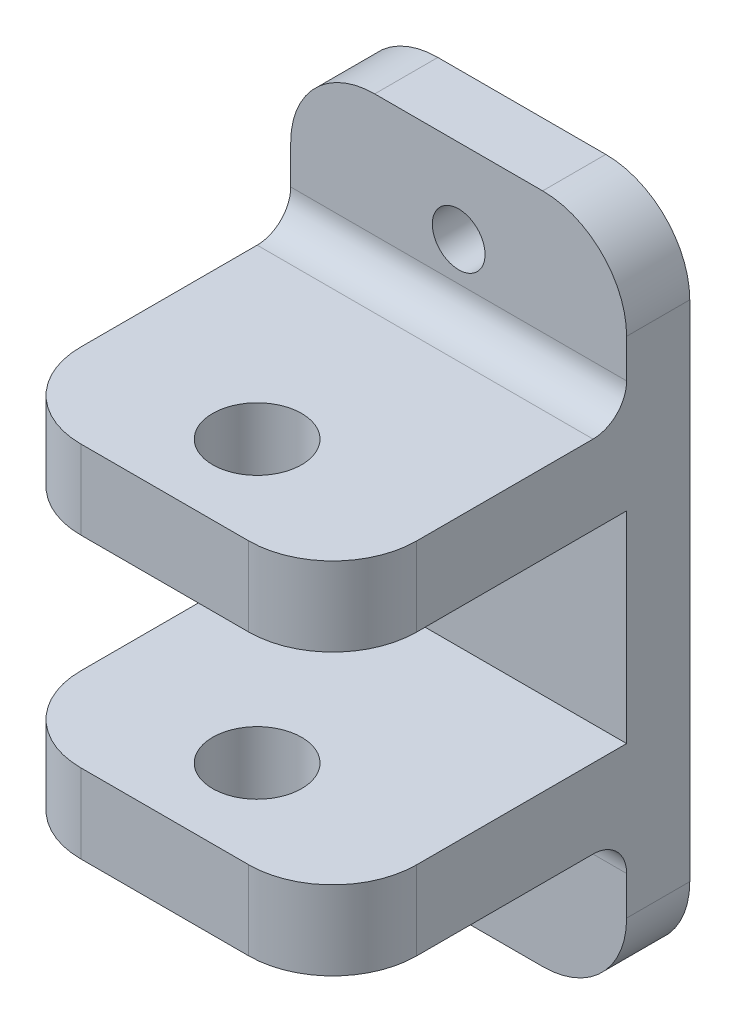
ISO-10303-21;
HEADER;
FILE_DESCRIPTION(('STEP AP214'),'2;1');
FILE_NAME('part.step','',(''),(''),'','','');
FILE_SCHEMA(('AUTOMOTIVE_DESIGN { 1 0 10303 214 1 1 1 1 }'));
ENDSEC;
DATA;
#1=APPLICATION_CONTEXT('core data for automotive mechanical design processes');
#2=APPLICATION_PROTOCOL_DEFINITION('international standard','automotive_design',2000,#1);
#3=PRODUCT_CONTEXT('',#1,'mechanical');
#4=PRODUCT('Part','Part','',(#3));
#5=PRODUCT_RELATED_PRODUCT_CATEGORY('part','',(#4));
#6=PRODUCT_DEFINITION_FORMATION('','',#4);
#7=PRODUCT_DEFINITION_CONTEXT('part definition',#1,'design');
#8=PRODUCT_DEFINITION('design','',#6,#7);
#9=PRODUCT_DEFINITION_SHAPE('','',#8);
#10=(LENGTH_UNIT() NAMED_UNIT(*) SI_UNIT(.MILLI.,.METRE.));
#11=(NAMED_UNIT(*) PLANE_ANGLE_UNIT() SI_UNIT($,.RADIAN.));
#12=(NAMED_UNIT(*) SI_UNIT($,.STERADIAN.) SOLID_ANGLE_UNIT());
#13=UNCERTAINTY_MEASURE_WITH_UNIT(LENGTH_MEASURE(1.E-05),#10,'distance_accuracy_value','');
#14=(GEOMETRIC_REPRESENTATION_CONTEXT(3) GLOBAL_UNCERTAINTY_ASSIGNED_CONTEXT((#13)) GLOBAL_UNIT_ASSIGNED_CONTEXT((#10,
#11,#12)) REPRESENTATION_CONTEXT('',''));
#15=CARTESIAN_POINT('',(0.,0.,0.));
#16=DIRECTION('',(0.,0.,1.));
#17=DIRECTION('',(1.,0.,0.));
#18=AXIS2_PLACEMENT_3D('',#15,#16,#17);
#19=CARTESIAN_POINT('',(0.,0.,4.7752));
#20=DIRECTION('',(0.,0.,1.));
#21=DIRECTION('',(0.,-1.,0.));
#22=AXIS2_PLACEMENT_3D('',#19,#20,#21);
#23=PLANE('',#22);
#24=DIRECTION('',(1.,0.,0.));
#25=VECTOR('',#24,1.);
#26=CARTESIAN_POINT('',(0.,24.13,4.7752));
#27=LINE('',#26,#25);
#28=CARTESIAN_POINT('',(-25.4,24.13,4.7752));
#29=VERTEX_POINT('',#28);
#30=CARTESIAN_POINT('',(0.,24.13,4.7752));
#31=VERTEX_POINT('',#30);
#32=EDGE_CURVE('E298',#29,#31,#27,.T.);
#33=ORIENTED_EDGE('',*,*,#32,.T.);
#34=DIRECTION('',(0.,-1.,0.));
#35=VECTOR('',#34,1.);
#36=CARTESIAN_POINT('',(0.,63.5,4.7752));
#37=LINE('',#36,#35);
#38=CARTESIAN_POINT('',(0.,39.37,4.7752));
#39=VERTEX_POINT('',#38);
#40=EDGE_CURVE('E445',#39,#31,#37,.T.);
#41=ORIENTED_EDGE('',*,*,#40,.F.);
#42=DIRECTION('',(-1.,0.,0.));
#43=VECTOR('',#42,1.);
#44=CARTESIAN_POINT('',(-12.7,39.37,4.7752));
#45=LINE('',#44,#43);
#46=CARTESIAN_POINT('',(-25.4,39.37,4.7752));
#47=VERTEX_POINT('',#46);
#48=EDGE_CURVE('E26',#39,#47,#45,.T.);
#49=ORIENTED_EDGE('',*,*,#48,.T.);
#50=DIRECTION('',(0.,1.,0.));
#51=VECTOR('',#50,1.);
#52=CARTESIAN_POINT('',(-25.4,63.5,4.7752));
#53=LINE('',#52,#51);
#54=EDGE_CURVE('E419',#29,#47,#53,.T.);
#55=ORIENTED_EDGE('',*,*,#54,.F.);
#56=EDGE_LOOP('',(#33,#41,#49,#55));
#57=FACE_BOUND('',#56,.T.);
#58=ADVANCED_FACE('F17',(#57),#23,.T.);
#59=CARTESIAN_POINT('',(-12.7,42.3545,27.0002));
#60=DIRECTION('',(0.,0.,1.));
#61=DIRECTION('',(1.,0.,0.));
#62=AXIS2_PLACEMENT_3D('',#59,#60,#61);
#63=PLANE('',#62);
#64=DIRECTION('',(0.,1.,0.));
#65=VECTOR('',#64,1.);
#66=CARTESIAN_POINT('',(-19.05,37.05225,27.0002));
#67=LINE('',#66,#65);
#68=CARTESIAN_POINT('',(-19.05,39.37,27.0002));
#69=VERTEX_POINT('',#68);
#70=CARTESIAN_POINT('',(-19.05,45.339,27.0002));
#71=VERTEX_POINT('',#70);
#72=EDGE_CURVE('E393',#69,#71,#67,.T.);
#73=ORIENTED_EDGE('',*,*,#72,.F.);
#74=DIRECTION('',(1.,0.,0.));
#75=VECTOR('',#74,1.);
#76=CARTESIAN_POINT('',(-25.4,39.37,27.0002));
#77=LINE('',#76,#75);
#78=CARTESIAN_POINT('',(-6.35,39.37,27.0002));
#79=VERTEX_POINT('',#78);
#80=EDGE_CURVE('E11',#69,#79,#77,.T.);
#81=ORIENTED_EDGE('',*,*,#80,.T.);
#82=DIRECTION('',(0.,-1.,0.));
#83=VECTOR('',#82,1.);
#84=CARTESIAN_POINT('',(-6.35,37.05225,27.0002));
#85=LINE('',#84,#83);
#86=CARTESIAN_POINT('',(-6.35,45.339,27.0002));
#87=VERTEX_POINT('',#86);
#88=EDGE_CURVE('E428',#87,#79,#85,.T.);
#89=ORIENTED_EDGE('',*,*,#88,.F.);
#90=DIRECTION('',(-1.,0.,0.));
#91=VECTOR('',#90,1.);
#92=CARTESIAN_POINT('',(0.,45.339,27.0002));
#93=LINE('',#92,#91);
#94=EDGE_CURVE('E518',#87,#71,#93,.T.);
#95=ORIENTED_EDGE('',*,*,#94,.T.);
#96=EDGE_LOOP('',(#73,#81,#89,#95));
#97=FACE_BOUND('',#96,.T.);
#98=ADVANCED_FACE('F556',(#97),#63,.T.);
#99=CARTESIAN_POINT('',(-25.4,39.37,4.7752));
#100=DIRECTION('',(0.,-1.,0.));
#101=DIRECTION('',(0.,0.,-1.));
#102=AXIS2_PLACEMENT_3D('',#99,#100,#101);
#103=PLANE('',#102);
#104=CARTESIAN_POINT('',(-12.7,39.37,20.0152));
#105=DIRECTION('',(0.,1.,0.));
#106=DIRECTION('',(1.,0.,0.));
#107=AXIS2_PLACEMENT_3D('',#104,#105,#106);
#108=CIRCLE('',#107,3.3655);
#109=CARTESIAN_POINT('',(-16.0655,39.37,20.0152));
#110=VERTEX_POINT('',#109);
#111=EDGE_CURVE('E50',#110,#110,#108,.T.);
#112=ORIENTED_EDGE('',*,*,#111,.T.);
#113=EDGE_LOOP('',(#112));
#114=FACE_BOUND('',#113,.T.);
#115=CARTESIAN_POINT('',(-19.05,39.37,20.6502));
#116=DIRECTION('',(0.,1.,0.));
#117=DIRECTION('',(-0.707106781186548,0.,0.707106781186547));
#118=AXIS2_PLACEMENT_3D('',#115,#116,#117);
#119=CIRCLE('',#118,6.35);
#120=CARTESIAN_POINT('',(-25.4,39.37,20.6502));
#121=VERTEX_POINT('',#120);
#122=EDGE_CURVE('E513',#121,#69,#119,.T.);
#123=ORIENTED_EDGE('',*,*,#122,.F.);
#124=DIRECTION('',(0.,0.,1.));
#125=VECTOR('',#124,1.);
#126=CARTESIAN_POINT('',(-25.4,39.37,4.7752));
#127=LINE('',#126,#125);
#128=EDGE_CURVE('E425',#47,#121,#127,.T.);
#129=ORIENTED_EDGE('',*,*,#128,.F.);
#130=ORIENTED_EDGE('',*,*,#48,.F.);
#131=DIRECTION('',(0.,0.,1.));
#132=VECTOR('',#131,1.);
#133=CARTESIAN_POINT('',(0.,39.37,4.7752));
#134=LINE('',#133,#132);
#135=CARTESIAN_POINT('',(0.,39.37,20.6502));
#136=VERTEX_POINT('',#135);
#137=EDGE_CURVE('E439',#39,#136,#134,.T.);
#138=ORIENTED_EDGE('',*,*,#137,.T.);
#139=CARTESIAN_POINT('',(-6.35,39.37,20.6502));
#140=DIRECTION('',(0.,1.,0.));
#141=DIRECTION('',(0.707106781186548,0.,0.707106781186547));
#142=AXIS2_PLACEMENT_3D('',#139,#140,#141);
#143=CIRCLE('',#142,6.35);
#144=EDGE_CURVE('E432',#79,#136,#143,.T.);
#145=ORIENTED_EDGE('',*,*,#144,.F.);
#146=ORIENTED_EDGE('',*,*,#80,.F.);
#147=EDGE_LOOP('',(#123,#129,#130,#138,#145,#146));
#148=FACE_BOUND('',#147,.T.);
#149=ADVANCED_FACE('F550',(#114,#148),#103,.T.);
#150=CARTESIAN_POINT('',(-12.7,21.1455,27.0002));
#151=DIRECTION('',(0.,0.,1.));
#152=DIRECTION('',(0.,-1.,0.));
#153=AXIS2_PLACEMENT_3D('',#150,#151,#152);
#154=PLANE('',#153);
#155=DIRECTION('',(0.,-1.,0.));
#156=VECTOR('',#155,1.);
#157=CARTESIAN_POINT('',(-6.35,26.44775,27.0002));
#158=LINE('',#157,#156);
#159=CARTESIAN_POINT('',(-6.35,24.13,27.0002));
#160=VERTEX_POINT('',#159);
#161=CARTESIAN_POINT('',(-6.35,18.161,27.0002));
#162=VERTEX_POINT('',#161);
#163=EDGE_CURVE('E319',#160,#162,#158,.T.);
#164=ORIENTED_EDGE('',*,*,#163,.F.);
#165=DIRECTION('',(-1.,0.,0.));
#166=VECTOR('',#165,1.);
#167=CARTESIAN_POINT('',(0.,24.13,27.0002));
#168=LINE('',#167,#166);
#169=CARTESIAN_POINT('',(-19.05,24.13,27.0002));
#170=VERTEX_POINT('',#169);
#171=EDGE_CURVE('E20',#160,#170,#168,.T.);
#172=ORIENTED_EDGE('',*,*,#171,.T.);
#173=DIRECTION('',(0.,1.,0.));
#174=VECTOR('',#173,1.);
#175=CARTESIAN_POINT('',(-19.05,26.44775,27.0002));
#176=LINE('',#175,#174);
#177=CARTESIAN_POINT('',(-19.05,18.161,27.0002));
#178=VERTEX_POINT('',#177);
#179=EDGE_CURVE('E316',#178,#170,#176,.T.);
#180=ORIENTED_EDGE('',*,*,#179,.F.);
#181=DIRECTION('',(1.,0.,0.));
#182=VECTOR('',#181,1.);
#183=CARTESIAN_POINT('',(-25.4,18.161,27.0002));
#184=LINE('',#183,#182);
#185=EDGE_CURVE('E505',#178,#162,#184,.T.);
#186=ORIENTED_EDGE('',*,*,#185,.T.);
#187=EDGE_LOOP('',(#164,#172,#180,#186));
#188=FACE_BOUND('',#187,.T.);
#189=ADVANCED_FACE('F313',(#188),#154,.T.);
#190=CARTESIAN_POINT('',(0.,24.13,4.7752));
#191=DIRECTION('',(0.,1.,0.));
#192=DIRECTION('',(0.,0.,-1.));
#193=AXIS2_PLACEMENT_3D('',#190,#191,#192);
#194=PLANE('',#193);
#195=CARTESIAN_POINT('',(-12.7,24.13,20.0152));
#196=DIRECTION('',(0.,-1.,0.));
#197=DIRECTION('',(1.,0.,0.));
#198=AXIS2_PLACEMENT_3D('',#195,#196,#197);
#199=CIRCLE('',#198,3.3655);
#200=CARTESIAN_POINT('',(-16.0655,24.13,20.0152));
#201=VERTEX_POINT('',#200);
#202=EDGE_CURVE('E290',#201,#201,#199,.T.);
#203=ORIENTED_EDGE('',*,*,#202,.T.);
#204=EDGE_LOOP('',(#203));
#205=FACE_BOUND('',#204,.T.);
#206=CARTESIAN_POINT('',(-6.35,24.13,20.6502));
#207=DIRECTION('',(0.,-1.,0.));
#208=DIRECTION('',(0.707106781186548,0.,0.707106781186547));
#209=AXIS2_PLACEMENT_3D('',#206,#207,#208);
#210=CIRCLE('',#209,6.35);
#211=CARTESIAN_POINT('',(0.,24.13,20.6502));
#212=VERTEX_POINT('',#211);
#213=EDGE_CURVE('E341',#212,#160,#210,.T.);
#214=ORIENTED_EDGE('',*,*,#213,.F.);
#215=DIRECTION('',(0.,0.,1.));
#216=VECTOR('',#215,1.);
#217=CARTESIAN_POINT('',(0.,24.13,4.7752));
#218=LINE('',#217,#216);
#219=EDGE_CURVE('E440',#31,#212,#218,.T.);
#220=ORIENTED_EDGE('',*,*,#219,.F.);
#221=ORIENTED_EDGE('',*,*,#32,.F.);
#222=DIRECTION('',(0.,0.,1.));
#223=VECTOR('',#222,1.);
#224=CARTESIAN_POINT('',(-25.4,24.13,4.7752));
#225=LINE('',#224,#223);
#226=CARTESIAN_POINT('',(-25.4,24.13,20.6502));
#227=VERTEX_POINT('',#226);
#228=EDGE_CURVE('E326',#29,#227,#225,.T.);
#229=ORIENTED_EDGE('',*,*,#228,.T.);
#230=CARTESIAN_POINT('',(-19.05,24.13,20.6502));
#231=DIRECTION('',(0.,-1.,0.));
#232=DIRECTION('',(-0.707106781186548,0.,0.707106781186547));
#233=AXIS2_PLACEMENT_3D('',#230,#231,#232);
#234=CIRCLE('',#233,6.35);
#235=EDGE_CURVE('E323',#170,#227,#234,.T.);
#236=ORIENTED_EDGE('',*,*,#235,.F.);
#237=ORIENTED_EDGE('',*,*,#171,.F.);
#238=EDGE_LOOP('',(#214,#220,#221,#229,#236,#237));
#239=FACE_BOUND('',#238,.T.);
#240=ADVANCED_FACE('F324',(#205,#239),#194,.T.);
#241=CARTESIAN_POINT('',(-12.7,50.8,4.7752));
#242=DIRECTION('',(0.,0.,-1.));
#243=DIRECTION('',(1.,0.,0.));
#244=AXIS2_PLACEMENT_3D('',#241,#242,#243);
#245=CYLINDRICAL_SURFACE('',#244,1.9939);
#246=CARTESIAN_POINT('',(-12.7,50.8,4.7752));
#247=DIRECTION('',(0.,0.,-1.));
#248=DIRECTION('',(1.,0.,0.));
#249=AXIS2_PLACEMENT_3D('',#246,#247,#248);
#250=CIRCLE('',#249,1.9939);
#251=CARTESIAN_POINT('',(-14.6939,50.8,4.7752));
#252=VERTEX_POINT('',#251);
#253=EDGE_CURVE('E276',#252,#252,#250,.T.);
#254=ORIENTED_EDGE('',*,*,#253,.F.);
#255=DIRECTION('',(0.,0.,-1.));
#256=VECTOR('',#255,1.);
#257=CARTESIAN_POINT('',(-14.6939,50.8,4.7752));
#258=LINE('',#257,#256);
#259=CARTESIAN_POINT('',(-14.6939,50.8,0.));
#260=VERTEX_POINT('',#259);
#261=EDGE_CURVE('E295',#252,#260,#258,.T.);
#262=ORIENTED_EDGE('',*,*,#261,.T.);
#263=CARTESIAN_POINT('',(-12.7,50.8,0.));
#264=DIRECTION('',(0.,0.,1.));
#265=DIRECTION('',(1.,0.,0.));
#266=AXIS2_PLACEMENT_3D('',#263,#264,#265);
#267=CIRCLE('',#266,1.9939);
#268=EDGE_CURVE('E264',#260,#260,#267,.T.);
#269=ORIENTED_EDGE('',*,*,#268,.F.);
#270=ORIENTED_EDGE('',*,*,#261,.F.);
#271=EDGE_LOOP('',(#254,#262,#269,#270));
#272=FACE_BOUND('',#271,.T.);
#273=ADVANCED_FACE('F676',(#272),#245,.F.);
#274=CARTESIAN_POINT('',(-12.7,12.7,4.7752));
#275=DIRECTION('',(0.,0.,-1.));
#276=DIRECTION('',(1.,0.,0.));
#277=AXIS2_PLACEMENT_3D('',#274,#275,#276);
#278=CYLINDRICAL_SURFACE('',#277,1.9939);
#279=CARTESIAN_POINT('',(-12.7,12.7,4.7752));
#280=DIRECTION('',(0.,0.,-1.));
#281=DIRECTION('',(1.,0.,0.));
#282=AXIS2_PLACEMENT_3D('',#279,#280,#281);
#283=CIRCLE('',#282,1.9939);
#284=CARTESIAN_POINT('',(-14.6939,12.7,4.7752));
#285=VERTEX_POINT('',#284);
#286=EDGE_CURVE('E281',#285,#285,#283,.T.);
#287=ORIENTED_EDGE('',*,*,#286,.F.);
#288=DIRECTION('',(0.,0.,-1.));
#289=VECTOR('',#288,1.);
#290=CARTESIAN_POINT('',(-14.6939,12.7,4.7752));
#291=LINE('',#290,#289);
#292=CARTESIAN_POINT('',(-14.6939,12.7,0.));
#293=VERTEX_POINT('',#292);
#294=EDGE_CURVE('E79',#285,#293,#291,.T.);
#295=ORIENTED_EDGE('',*,*,#294,.T.);
#296=CARTESIAN_POINT('',(-12.7,12.7,0.));
#297=DIRECTION('',(0.,0.,1.));
#298=DIRECTION('',(1.,0.,0.));
#299=AXIS2_PLACEMENT_3D('',#296,#297,#298);
#300=CIRCLE('',#299,1.9939);
#301=EDGE_CURVE('E247',#293,#293,#300,.T.);
#302=ORIENTED_EDGE('',*,*,#301,.F.);
#303=ORIENTED_EDGE('',*,*,#294,.F.);
#304=EDGE_LOOP('',(#287,#295,#302,#303));
#305=FACE_BOUND('',#304,.T.);
#306=ADVANCED_FACE('F665',(#305),#278,.F.);
#307=CARTESIAN_POINT('',(-12.7,45.339,20.0152));
#308=DIRECTION('',(0.,-1.,0.));
#309=DIRECTION('',(1.,0.,0.));
#310=AXIS2_PLACEMENT_3D('',#307,#308,#309);
#311=CYLINDRICAL_SURFACE('',#310,3.3655);
#312=ORIENTED_EDGE('',*,*,#202,.F.);
#313=DIRECTION('',(0.,-1.,0.));
#314=VECTOR('',#313,1.);
#315=CARTESIAN_POINT('',(-16.0655,45.339,20.0152));
#316=LINE('',#315,#314);
#317=CARTESIAN_POINT('',(-16.0655,18.161,20.0152));
#318=VERTEX_POINT('',#317);
#319=EDGE_CURVE('E39',#201,#318,#316,.T.);
#320=ORIENTED_EDGE('',*,*,#319,.T.);
#321=CARTESIAN_POINT('',(-12.7,18.161,20.0152));
#322=DIRECTION('',(0.,1.,0.));
#323=DIRECTION('',(1.,0.,0.));
#324=AXIS2_PLACEMENT_3D('',#321,#322,#323);
#325=CIRCLE('',#324,3.3655);
#326=EDGE_CURVE('E506',#318,#318,#325,.T.);
#327=ORIENTED_EDGE('',*,*,#326,.F.);
#328=ORIENTED_EDGE('',*,*,#319,.F.);
#329=EDGE_LOOP('',(#312,#320,#327,#328));
#330=FACE_BOUND('',#329,.T.);
#331=ADVANCED_FACE('F661',(#330),#311,.F.);
#332=CARTESIAN_POINT('',(-12.7,45.339,20.0152));
#333=DIRECTION('',(0.,-1.,0.));
#334=DIRECTION('',(1.,0.,0.));
#335=AXIS2_PLACEMENT_3D('',#332,#333,#334);
#336=CYLINDRICAL_SURFACE('',#335,3.3655);
#337=CARTESIAN_POINT('',(-12.7,45.339,20.0152));
#338=DIRECTION('',(0.,-1.,0.));
#339=DIRECTION('',(1.,0.,0.));
#340=AXIS2_PLACEMENT_3D('',#337,#338,#339);
#341=CIRCLE('',#340,3.3655);
#342=CARTESIAN_POINT('',(-16.0655,45.339,20.0152));
#343=VERTEX_POINT('',#342);
#344=EDGE_CURVE('E530',#343,#343,#341,.T.);
#345=ORIENTED_EDGE('',*,*,#344,.F.);
#346=DIRECTION('',(0.,-1.,0.));
#347=VECTOR('',#346,1.);
#348=CARTESIAN_POINT('',(-16.0655,45.339,20.0152));
#349=LINE('',#348,#347);
#350=EDGE_CURVE('E280',#343,#110,#349,.T.);
#351=ORIENTED_EDGE('',*,*,#350,.T.);
#352=ORIENTED_EDGE('',*,*,#111,.F.);
#353=ORIENTED_EDGE('',*,*,#350,.F.);
#354=EDGE_LOOP('',(#345,#351,#352,#353));
#355=FACE_BOUND('',#354,.T.);
#356=ADVANCED_FACE('F664',(#355),#336,.F.);
#357=CARTESIAN_POINT('',(0.,0.,4.7752));
#358=DIRECTION('',(0.,0.,1.));
#359=DIRECTION('',(0.,-1.,0.));
#360=AXIS2_PLACEMENT_3D('',#357,#358,#359);
#361=PLANE('',#360);
#362=ORIENTED_EDGE('',*,*,#253,.T.);
#363=EDGE_LOOP('',(#362));
#364=FACE_BOUND('',#363,.T.);
#365=DIRECTION('',(-1.,0.,0.));
#366=VECTOR('',#365,1.);
#367=CARTESIAN_POINT('',(0.,47.879,4.7752));
#368=LINE('',#367,#366);
#369=CARTESIAN_POINT('',(0.,47.879,4.7752));
#370=VERTEX_POINT('',#369);
#371=CARTESIAN_POINT('',(-25.4,47.879,4.7752));
#372=VERTEX_POINT('',#371);
#373=EDGE_CURVE('E477',#370,#372,#368,.T.);
#374=ORIENTED_EDGE('',*,*,#373,.F.);
#375=DIRECTION('',(0.,-1.,0.));
#376=VECTOR('',#375,1.);
#377=CARTESIAN_POINT('',(0.,63.5,4.7752));
#378=LINE('',#377,#376);
#379=CARTESIAN_POINT('',(0.,50.8,4.7752));
#380=VERTEX_POINT('',#379);
#381=EDGE_CURVE('E410',#380,#370,#378,.T.);
#382=ORIENTED_EDGE('',*,*,#381,.F.);
#383=CARTESIAN_POINT('',(-6.35,50.8,4.7752));
#384=DIRECTION('',(0.,0.,-1.));
#385=DIRECTION('',(0.707106781186548,0.707106781186547,0.));
#386=AXIS2_PLACEMENT_3D('',#383,#384,#385);
#387=CIRCLE('',#386,6.35);
#388=CARTESIAN_POINT('',(-6.35,57.15,4.7752));
#389=VERTEX_POINT('',#388);
#390=EDGE_CURVE('E236',#389,#380,#387,.T.);
#391=ORIENTED_EDGE('',*,*,#390,.F.);
#392=DIRECTION('',(-1.,0.,0.));
#393=VECTOR('',#392,1.);
#394=CARTESIAN_POINT('',(0.,57.15,4.7752));
#395=LINE('',#394,#393);
#396=CARTESIAN_POINT('',(-19.05,57.15,4.7752));
#397=VERTEX_POINT('',#396);
#398=EDGE_CURVE('E90',#389,#397,#395,.T.);
#399=ORIENTED_EDGE('',*,*,#398,.T.);
#400=CARTESIAN_POINT('',(-19.05,50.8,4.7752));
#401=DIRECTION('',(0.,0.,-1.));
#402=DIRECTION('',(-0.707106781186548,0.707106781186547,0.));
#403=AXIS2_PLACEMENT_3D('',#400,#401,#402);
#404=CIRCLE('',#403,6.35);
#405=CARTESIAN_POINT('',(-25.4,50.8,4.7752));
#406=VERTEX_POINT('',#405);
#407=EDGE_CURVE('E273',#406,#397,#404,.T.);
#408=ORIENTED_EDGE('',*,*,#407,.F.);
#409=DIRECTION('',(0.,1.,0.));
#410=VECTOR('',#409,1.);
#411=CARTESIAN_POINT('',(-25.4,63.5,4.7752));
#412=LINE('',#411,#410);
#413=EDGE_CURVE('E398',#372,#406,#412,.T.);
#414=ORIENTED_EDGE('',*,*,#413,.F.);
#415=EDGE_LOOP('',(#374,#382,#391,#399,#408,#414));
#416=FACE_BOUND('',#415,.T.);
#417=ADVANCED_FACE('F478',(#364,#416),#361,.T.);
#418=CARTESIAN_POINT('',(0.,0.,4.7752));
#419=DIRECTION('',(0.,0.,1.));
#420=DIRECTION('',(0.,-1.,0.));
#421=AXIS2_PLACEMENT_3D('',#418,#419,#420);
#422=PLANE('',#421);
#423=ORIENTED_EDGE('',*,*,#286,.T.);
#424=EDGE_LOOP('',(#423));
#425=FACE_BOUND('',#424,.T.);
#426=DIRECTION('',(1.,0.,0.));
#427=VECTOR('',#426,1.);
#428=CARTESIAN_POINT('',(-12.7,15.621,4.7752));
#429=LINE('',#428,#427);
#430=CARTESIAN_POINT('',(-25.4,15.621,4.7752));
#431=VERTEX_POINT('',#430);
#432=CARTESIAN_POINT('',(0.,15.621,4.7752));
#433=VERTEX_POINT('',#432);
#434=EDGE_CURVE('E585',#431,#433,#429,.T.);
#435=ORIENTED_EDGE('',*,*,#434,.F.);
#436=DIRECTION('',(0.,1.,0.));
#437=VECTOR('',#436,1.);
#438=CARTESIAN_POINT('',(-25.4,63.5,4.7752));
#439=LINE('',#438,#437);
#440=CARTESIAN_POINT('',(-25.4,12.7,4.7752));
#441=VERTEX_POINT('',#440);
#442=EDGE_CURVE('E407',#441,#431,#439,.T.);
#443=ORIENTED_EDGE('',*,*,#442,.F.);
#444=CARTESIAN_POINT('',(-19.05,12.7,4.7752));
#445=DIRECTION('',(0.,0.,-1.));
#446=DIRECTION('',(-0.707106781186547,-0.707106781186548,0.));
#447=AXIS2_PLACEMENT_3D('',#444,#445,#446);
#448=CIRCLE('',#447,6.35);
#449=CARTESIAN_POINT('',(-19.05,6.35,4.7752));
#450=VERTEX_POINT('',#449);
#451=EDGE_CURVE('E268',#450,#441,#448,.T.);
#452=ORIENTED_EDGE('',*,*,#451,.F.);
#453=DIRECTION('',(1.,0.,0.));
#454=VECTOR('',#453,1.);
#455=CARTESIAN_POINT('',(-12.7,6.35,4.7752));
#456=LINE('',#455,#454);
#457=CARTESIAN_POINT('',(-6.35,6.35,4.7752));
#458=VERTEX_POINT('',#457);
#459=EDGE_CURVE('E235',#450,#458,#456,.T.);
#460=ORIENTED_EDGE('',*,*,#459,.T.);
#461=CARTESIAN_POINT('',(-6.35,12.7,4.7752));
#462=DIRECTION('',(0.,0.,-1.));
#463=DIRECTION('',(0.707106781186547,-0.707106781186548,0.));
#464=AXIS2_PLACEMENT_3D('',#461,#462,#463);
#465=CIRCLE('',#464,6.35);
#466=CARTESIAN_POINT('',(0.,12.7,4.7752));
#467=VERTEX_POINT('',#466);
#468=EDGE_CURVE('E347',#467,#458,#465,.T.);
#469=ORIENTED_EDGE('',*,*,#468,.F.);
#470=DIRECTION('',(0.,-1.,0.));
#471=VECTOR('',#470,1.);
#472=CARTESIAN_POINT('',(0.,63.5,4.7752));
#473=LINE('',#472,#471);
#474=EDGE_CURVE('E383',#433,#467,#473,.T.);
#475=ORIENTED_EDGE('',*,*,#474,.F.);
#476=EDGE_LOOP('',(#435,#443,#452,#460,#469,#475));
#477=FACE_BOUND('',#476,.T.);
#478=ADVANCED_FACE('F381',(#425,#477),#422,.T.);
#479=CARTESIAN_POINT('',(0.,57.15,4.7752));
#480=DIRECTION('',(0.,-1.,0.));
#481=DIRECTION('',(0.,0.,-1.));
#482=AXIS2_PLACEMENT_3D('',#479,#480,#481);
#483=PLANE('',#482);
#484=DIRECTION('',(0.,0.,-1.));
#485=VECTOR('',#484,1.);
#486=CARTESIAN_POINT('',(-19.05,57.15,3.5814));
#487=LINE('',#486,#485);
#488=CARTESIAN_POINT('',(-19.05,57.15,0.));
#489=VERTEX_POINT('',#488);
#490=EDGE_CURVE('E223',#397,#489,#487,.T.);
#491=ORIENTED_EDGE('',*,*,#490,.F.);
#492=ORIENTED_EDGE('',*,*,#398,.F.);
#493=DIRECTION('',(0.,0.,1.));
#494=VECTOR('',#493,1.);
#495=CARTESIAN_POINT('',(-6.35,57.15,3.5814));
#496=LINE('',#495,#494);
#497=CARTESIAN_POINT('',(-6.35,57.15,0.));
#498=VERTEX_POINT('',#497);
#499=EDGE_CURVE('E226',#498,#389,#496,.T.);
#500=ORIENTED_EDGE('',*,*,#499,.F.);
#501=DIRECTION('',(1.,0.,0.));
#502=VECTOR('',#501,1.);
#503=CARTESIAN_POINT('',(0.,57.15,0.));
#504=LINE('',#503,#502);
#505=EDGE_CURVE('E230',#489,#498,#504,.T.);
#506=ORIENTED_EDGE('',*,*,#505,.F.);
#507=EDGE_LOOP('',(#491,#492,#500,#506));
#508=FACE_BOUND('',#507,.T.);
#509=ADVANCED_FACE('F228',(#508),#483,.F.);
#510=CARTESIAN_POINT('',(-25.4,6.35,4.7752));
#511=DIRECTION('',(0.,1.,0.));
#512=DIRECTION('',(0.,0.,-1.));
#513=AXIS2_PLACEMENT_3D('',#510,#511,#512);
#514=PLANE('',#513);
#515=DIRECTION('',(0.,0.,-1.));
#516=VECTOR('',#515,1.);
#517=CARTESIAN_POINT('',(-6.35,6.35,3.5814));
#518=LINE('',#517,#516);
#519=CARTESIAN_POINT('',(-6.35,6.35,0.));
#520=VERTEX_POINT('',#519);
#521=EDGE_CURVE('E351',#458,#520,#518,.T.);
#522=ORIENTED_EDGE('',*,*,#521,.F.);
#523=ORIENTED_EDGE('',*,*,#459,.F.);
#524=DIRECTION('',(0.,0.,1.));
#525=VECTOR('',#524,1.);
#526=CARTESIAN_POINT('',(-19.05,6.35,3.5814));
#527=LINE('',#526,#525);
#528=CARTESIAN_POINT('',(-19.05,6.35,0.));
#529=VERTEX_POINT('',#528);
#530=EDGE_CURVE('E269',#529,#450,#527,.T.);
#531=ORIENTED_EDGE('',*,*,#530,.F.);
#532=DIRECTION('',(-1.,0.,0.));
#533=VECTOR('',#532,1.);
#534=CARTESIAN_POINT('',(-12.7,6.35,0.));
#535=LINE('',#534,#533);
#536=EDGE_CURVE('E355',#520,#529,#535,.T.);
#537=ORIENTED_EDGE('',*,*,#536,.F.);
#538=EDGE_LOOP('',(#522,#523,#531,#537));
#539=FACE_BOUND('',#538,.T.);
#540=ADVANCED_FACE('F371',(#539),#514,.F.);
#541=CARTESIAN_POINT('',(-6.35,50.8,3.5814));
#542=DIRECTION('',(0.,0.,1.));
#543=DIRECTION('',(0.707106781186548,0.707106781186547,0.));
#544=AXIS2_PLACEMENT_3D('',#541,#542,#543);
#545=CYLINDRICAL_SURFACE('',#544,6.35);
#546=ORIENTED_EDGE('',*,*,#390,.T.);
#547=DIRECTION('',(0.,0.,-1.));
#548=VECTOR('',#547,1.);
#549=CARTESIAN_POINT('',(0.,50.8,3.5814));
#550=LINE('',#549,#548);
#551=CARTESIAN_POINT('',(0.,50.8,0.));
#552=VERTEX_POINT('',#551);
#553=EDGE_CURVE('E242',#380,#552,#550,.T.);
#554=ORIENTED_EDGE('',*,*,#553,.T.);
#555=CARTESIAN_POINT('',(-6.35,50.8,0.));
#556=DIRECTION('',(0.,0.,1.));
#557=DIRECTION('',(0.707106781186548,0.707106781186547,0.));
#558=AXIS2_PLACEMENT_3D('',#555,#556,#557);
#559=CIRCLE('',#558,6.35);
#560=EDGE_CURVE('E239',#552,#498,#559,.T.);
#561=ORIENTED_EDGE('',*,*,#560,.T.);
#562=ORIENTED_EDGE('',*,*,#499,.T.);
#563=EDGE_LOOP('',(#546,#554,#561,#562));
#564=FACE_BOUND('',#563,.T.);
#565=ADVANCED_FACE('F240',(#564),#545,.T.);
#566=CARTESIAN_POINT('',(-19.05,50.8,3.5814));
#567=DIRECTION('',(0.,0.,-1.));
#568=DIRECTION('',(-0.707106781186548,0.707106781186547,0.));
#569=AXIS2_PLACEMENT_3D('',#566,#567,#568);
#570=CYLINDRICAL_SURFACE('',#569,6.35);
#571=CARTESIAN_POINT('',(-19.05,50.8,0.));
#572=DIRECTION('',(0.,0.,1.));
#573=DIRECTION('',(-0.707106781186548,0.707106781186547,0.));
#574=AXIS2_PLACEMENT_3D('',#571,#572,#573);
#575=CIRCLE('',#574,6.35);
#576=CARTESIAN_POINT('',(-25.4,50.8,0.));
#577=VERTEX_POINT('',#576);
#578=EDGE_CURVE('E252',#489,#577,#575,.T.);
#579=ORIENTED_EDGE('',*,*,#578,.T.);
#580=DIRECTION('',(0.,0.,1.));
#581=VECTOR('',#580,1.);
#582=CARTESIAN_POINT('',(-25.4,50.8,3.5814));
#583=LINE('',#582,#581);
#584=EDGE_CURVE('E397',#577,#406,#583,.T.);
#585=ORIENTED_EDGE('',*,*,#584,.T.);
#586=ORIENTED_EDGE('',*,*,#407,.T.);
#587=ORIENTED_EDGE('',*,*,#490,.T.);
#588=EDGE_LOOP('',(#579,#585,#586,#587));
#589=FACE_BOUND('',#588,.T.);
#590=ADVANCED_FACE('F637',(#589),#570,.T.);
#591=CARTESIAN_POINT('',(-19.05,12.7,3.5814));
#592=DIRECTION('',(0.,0.,1.));
#593=DIRECTION('',(-0.707106781186547,-0.707106781186548,0.));
#594=AXIS2_PLACEMENT_3D('',#591,#592,#593);
#595=CYLINDRICAL_SURFACE('',#594,6.35);
#596=ORIENTED_EDGE('',*,*,#451,.T.);
#597=DIRECTION('',(0.,0.,-1.));
#598=VECTOR('',#597,1.);
#599=CARTESIAN_POINT('',(-25.4,12.7,3.5814));
#600=LINE('',#599,#598);
#601=CARTESIAN_POINT('',(-25.4,12.7,0.));
#602=VERTEX_POINT('',#601);
#603=EDGE_CURVE('E367',#441,#602,#600,.T.);
#604=ORIENTED_EDGE('',*,*,#603,.T.);
#605=CARTESIAN_POINT('',(-19.05,12.7,0.));
#606=DIRECTION('',(0.,0.,1.));
#607=DIRECTION('',(-0.707106781186547,-0.707106781186548,0.));
#608=AXIS2_PLACEMENT_3D('',#605,#606,#607);
#609=CIRCLE('',#608,6.35);
#610=EDGE_CURVE('E257',#602,#529,#609,.T.);
#611=ORIENTED_EDGE('',*,*,#610,.T.);
#612=ORIENTED_EDGE('',*,*,#530,.T.);
#613=EDGE_LOOP('',(#596,#604,#611,#612));
#614=FACE_BOUND('',#613,.T.);
#615=ADVANCED_FACE('F364',(#614),#595,.T.);
#616=CARTESIAN_POINT('',(0.,63.5,0.));
#617=DIRECTION('',(0.,0.,-1.));
#618=DIRECTION('',(-1.,0.,0.));
#619=AXIS2_PLACEMENT_3D('',#616,#617,#618);
#620=PLANE('',#619);
#621=ORIENTED_EDGE('',*,*,#268,.T.);
#622=EDGE_LOOP('',(#621));
#623=FACE_BOUND('',#622,.T.);
#624=ORIENTED_EDGE('',*,*,#301,.T.);
#625=EDGE_LOOP('',(#624));
#626=FACE_BOUND('',#625,.T.);
#627=CARTESIAN_POINT('',(-6.35,12.7,0.));
#628=DIRECTION('',(0.,0.,1.));
#629=DIRECTION('',(0.707106781186547,-0.707106781186548,0.));
#630=AXIS2_PLACEMENT_3D('',#627,#628,#629);
#631=CIRCLE('',#630,6.35);
#632=CARTESIAN_POINT('',(0.,12.7,0.));
#633=VERTEX_POINT('',#632);
#634=EDGE_CURVE('E330',#520,#633,#631,.T.);
#635=ORIENTED_EDGE('',*,*,#634,.F.);
#636=ORIENTED_EDGE('',*,*,#536,.T.);
#637=ORIENTED_EDGE('',*,*,#610,.F.);
#638=DIRECTION('',(0.,-1.,0.));
#639=VECTOR('',#638,1.);
#640=CARTESIAN_POINT('',(-25.4,0.,0.));
#641=LINE('',#640,#639);
#642=EDGE_CURVE('E395',#577,#602,#641,.T.);
#643=ORIENTED_EDGE('',*,*,#642,.F.);
#644=ORIENTED_EDGE('',*,*,#578,.F.);
#645=ORIENTED_EDGE('',*,*,#505,.T.);
#646=ORIENTED_EDGE('',*,*,#560,.F.);
#647=DIRECTION('',(0.,1.,0.));
#648=VECTOR('',#647,1.);
#649=CARTESIAN_POINT('',(0.,0.,0.));
#650=LINE('',#649,#648);
#651=EDGE_CURVE('E459',#633,#552,#650,.T.);
#652=ORIENTED_EDGE('',*,*,#651,.F.);
#653=EDGE_LOOP('',(#635,#636,#637,#643,#644,#645,#646,#652));
#654=FACE_BOUND('',#653,.T.);
#655=ADVANCED_FACE('F250',(#623,#626,#654),#620,.T.);
#656=CARTESIAN_POINT('',(-6.35,12.7,3.5814));
#657=DIRECTION('',(0.,0.,-1.));
#658=DIRECTION('',(0.707106781186547,-0.707106781186548,0.));
#659=AXIS2_PLACEMENT_3D('',#656,#657,#658);
#660=CYLINDRICAL_SURFACE('',#659,6.35);
#661=ORIENTED_EDGE('',*,*,#634,.T.);
#662=DIRECTION('',(0.,0.,1.));
#663=VECTOR('',#662,1.);
#664=CARTESIAN_POINT('',(0.,12.7,3.5814));
#665=LINE('',#664,#663);
#666=EDGE_CURVE('E376',#633,#467,#665,.T.);
#667=ORIENTED_EDGE('',*,*,#666,.T.);
#668=ORIENTED_EDGE('',*,*,#468,.T.);
#669=ORIENTED_EDGE('',*,*,#521,.T.);
#670=EDGE_LOOP('',(#661,#667,#668,#669));
#671=FACE_BOUND('',#670,.T.);
#672=ADVANCED_FACE('F373',(#671),#660,.T.);
#673=CARTESIAN_POINT('',(-19.05,26.44775,20.6502));
#674=DIRECTION('',(0.,-1.,0.));
#675=DIRECTION('',(-0.707106781186548,0.,0.707106781186547));
#676=AXIS2_PLACEMENT_3D('',#673,#674,#675);
#677=CYLINDRICAL_SURFACE('',#676,6.35);
#678=CARTESIAN_POINT('',(-19.05,18.161,20.6502));
#679=DIRECTION('',(0.,1.,0.));
#680=DIRECTION('',(-0.707106781186548,0.,0.707106781186547));
#681=AXIS2_PLACEMENT_3D('',#678,#679,#680);
#682=CIRCLE('',#681,6.35);
#683=CARTESIAN_POINT('',(-25.4,18.161,20.6502));
#684=VERTEX_POINT('',#683);
#685=EDGE_CURVE('E334',#684,#178,#682,.T.);
#686=ORIENTED_EDGE('',*,*,#685,.T.);
#687=ORIENTED_EDGE('',*,*,#179,.T.);
#688=ORIENTED_EDGE('',*,*,#235,.T.);
#689=DIRECTION('',(0.,-1.,0.));
#690=VECTOR('',#689,1.);
#691=CARTESIAN_POINT('',(-25.4,26.44775,20.6502));
#692=LINE('',#691,#690);
#693=EDGE_CURVE('E414',#227,#684,#692,.T.);
#694=ORIENTED_EDGE('',*,*,#693,.T.);
#695=EDGE_LOOP('',(#686,#687,#688,#694));
#696=FACE_BOUND('',#695,.T.);
#697=ADVANCED_FACE('F332',(#696),#677,.T.);
#698=CARTESIAN_POINT('',(-6.35,26.44775,20.6502));
#699=DIRECTION('',(0.,1.,0.));
#700=DIRECTION('',(0.707106781186548,0.,0.707106781186547));
#701=AXIS2_PLACEMENT_3D('',#698,#699,#700);
#702=CYLINDRICAL_SURFACE('',#701,6.35);
#703=CARTESIAN_POINT('',(-6.35,18.161,20.6502));
#704=DIRECTION('',(0.,1.,0.));
#705=DIRECTION('',(0.707106781186548,0.,0.707106781186547));
#706=AXIS2_PLACEMENT_3D('',#703,#704,#705);
#707=CIRCLE('',#706,6.35);
#708=CARTESIAN_POINT('',(0.,18.161,20.6502));
#709=VERTEX_POINT('',#708);
#710=EDGE_CURVE('E501',#162,#709,#707,.T.);
#711=ORIENTED_EDGE('',*,*,#710,.T.);
#712=DIRECTION('',(0.,1.,0.));
#713=VECTOR('',#712,1.);
#714=CARTESIAN_POINT('',(0.,26.44775,20.6502));
#715=LINE('',#714,#713);
#716=EDGE_CURVE('E444',#709,#212,#715,.T.);
#717=ORIENTED_EDGE('',*,*,#716,.T.);
#718=ORIENTED_EDGE('',*,*,#213,.T.);
#719=ORIENTED_EDGE('',*,*,#163,.T.);
#720=EDGE_LOOP('',(#711,#717,#718,#719));
#721=FACE_BOUND('',#720,.T.);
#722=ADVANCED_FACE('F788',(#721),#702,.T.);
#723=CARTESIAN_POINT('',(0.,31.75,2.3876));
#724=DIRECTION('',(1.,0.,0.));
#725=DIRECTION('',(0.,1.,0.));
#726=AXIS2_PLACEMENT_3D('',#723,#724,#725);
#727=PLANE('',#726);
#728=DIRECTION('',(0.,1.,0.));
#729=VECTOR('',#728,1.);
#730=CARTESIAN_POINT('',(0.,37.05225,20.6502));
#731=LINE('',#730,#729);
#732=CARTESIAN_POINT('',(0.,45.339,20.6502));
#733=VERTEX_POINT('',#732);
#734=EDGE_CURVE('E436',#136,#733,#731,.T.);
#735=ORIENTED_EDGE('',*,*,#734,.F.);
#736=ORIENTED_EDGE('',*,*,#137,.F.);
#737=ORIENTED_EDGE('',*,*,#40,.T.);
#738=ORIENTED_EDGE('',*,*,#219,.T.);
#739=ORIENTED_EDGE('',*,*,#716,.F.);
#740=DIRECTION('',(0.,0.,1.));
#741=VECTOR('',#740,1.);
#742=CARTESIAN_POINT('',(0.,18.161,4.7752));
#743=LINE('',#742,#741);
#744=CARTESIAN_POINT('',(0.,18.161,7.3152));
#745=VERTEX_POINT('',#744);
#746=EDGE_CURVE('E498',#745,#709,#743,.T.);
#747=ORIENTED_EDGE('',*,*,#746,.F.);
#748=CARTESIAN_POINT('',(0.,15.621,7.3152));
#749=DIRECTION('',(1.,0.,0.));
#750=DIRECTION('',(0.,0.707106781186548,-0.707106781186548));
#751=AXIS2_PLACEMENT_3D('',#748,#749,#750);
#752=CIRCLE('',#751,2.54);
#753=EDGE_CURVE('E571',#433,#745,#752,.T.);
#754=ORIENTED_EDGE('',*,*,#753,.F.);
#755=ORIENTED_EDGE('',*,*,#474,.T.);
#756=ORIENTED_EDGE('',*,*,#666,.F.);
#757=ORIENTED_EDGE('',*,*,#651,.T.);
#758=ORIENTED_EDGE('',*,*,#553,.F.);
#759=ORIENTED_EDGE('',*,*,#381,.T.);
#760=CARTESIAN_POINT('',(0.,47.879,7.3152));
#761=DIRECTION('',(1.,0.,0.));
#762=DIRECTION('',(0.,-0.707106781186549,-0.707106781186546));
#763=AXIS2_PLACEMENT_3D('',#760,#761,#762);
#764=CIRCLE('',#763,2.54);
#765=CARTESIAN_POINT('',(0.,45.339,7.3152));
#766=VERTEX_POINT('',#765);
#767=EDGE_CURVE('E471',#766,#370,#764,.T.);
#768=ORIENTED_EDGE('',*,*,#767,.F.);
#769=DIRECTION('',(0.,0.,1.));
#770=VECTOR('',#769,1.);
#771=CARTESIAN_POINT('',(0.,45.339,4.7752));
#772=LINE('',#771,#770);
#773=EDGE_CURVE('E527',#766,#733,#772,.T.);
#774=ORIENTED_EDGE('',*,*,#773,.T.);
#775=EDGE_LOOP('',(#735,#736,#737,#738,#739,#747,#754,#755,#756,#757,#758,#759,#768,#774));
#776=FACE_BOUND('',#775,.T.);
#777=ADVANCED_FACE('F468',(#776),#727,.T.);
#778=CARTESIAN_POINT('',(-6.35,37.05225,20.6502));
#779=DIRECTION('',(0.,1.,0.));
#780=DIRECTION('',(0.707106781186548,0.,0.707106781186547));
#781=AXIS2_PLACEMENT_3D('',#778,#779,#780);
#782=CYLINDRICAL_SURFACE('',#781,6.35);
#783=CARTESIAN_POINT('',(-6.35,45.339,20.6502));
#784=DIRECTION('',(0.,-1.,0.));
#785=DIRECTION('',(0.707106781186548,0.,0.707106781186547));
#786=AXIS2_PLACEMENT_3D('',#783,#784,#785);
#787=CIRCLE('',#786,6.35);
#788=EDGE_CURVE('E522',#733,#87,#787,.T.);
#789=ORIENTED_EDGE('',*,*,#788,.T.);
#790=ORIENTED_EDGE('',*,*,#88,.T.);
#791=ORIENTED_EDGE('',*,*,#144,.T.);
#792=ORIENTED_EDGE('',*,*,#734,.T.);
#793=EDGE_LOOP('',(#789,#790,#791,#792));
#794=FACE_BOUND('',#793,.T.);
#795=ADVANCED_FACE('F820',(#794),#782,.T.);
#796=CARTESIAN_POINT('',(-25.4,31.75,2.3876));
#797=DIRECTION('',(-1.,0.,0.));
#798=DIRECTION('',(0.,0.,1.));
#799=AXIS2_PLACEMENT_3D('',#796,#797,#798);
#800=PLANE('',#799);
#801=DIRECTION('',(0.,-1.,0.));
#802=VECTOR('',#801,1.);
#803=CARTESIAN_POINT('',(-25.4,37.05225,20.6502));
#804=LINE('',#803,#802);
#805=CARTESIAN_POINT('',(-25.4,45.339,20.6502));
#806=VERTEX_POINT('',#805);
#807=EDGE_CURVE('E516',#806,#121,#804,.T.);
#808=ORIENTED_EDGE('',*,*,#807,.F.);
#809=DIRECTION('',(0.,0.,1.));
#810=VECTOR('',#809,1.);
#811=CARTESIAN_POINT('',(-25.4,45.339,4.7752));
#812=LINE('',#811,#810);
#813=CARTESIAN_POINT('',(-25.4,45.339,7.3152));
#814=VERTEX_POINT('',#813);
#815=EDGE_CURVE('E483',#814,#806,#812,.T.);
#816=ORIENTED_EDGE('',*,*,#815,.F.);
#817=CARTESIAN_POINT('',(-25.4,47.879,7.3152));
#818=DIRECTION('',(-1.,0.,0.));
#819=DIRECTION('',(0.,-0.707106781186549,-0.707106781186546));
#820=AXIS2_PLACEMENT_3D('',#817,#818,#819);
#821=CIRCLE('',#820,2.54);
#822=EDGE_CURVE('E494',#372,#814,#821,.T.);
#823=ORIENTED_EDGE('',*,*,#822,.F.);
#824=ORIENTED_EDGE('',*,*,#413,.T.);
#825=ORIENTED_EDGE('',*,*,#584,.F.);
#826=ORIENTED_EDGE('',*,*,#642,.T.);
#827=ORIENTED_EDGE('',*,*,#603,.F.);
#828=ORIENTED_EDGE('',*,*,#442,.T.);
#829=CARTESIAN_POINT('',(-25.4,15.621,7.3152));
#830=DIRECTION('',(-1.,0.,0.));
#831=DIRECTION('',(0.,0.707106781186548,-0.707106781186548));
#832=AXIS2_PLACEMENT_3D('',#829,#830,#831);
#833=CIRCLE('',#832,2.54);
#834=CARTESIAN_POINT('',(-25.4,18.161,7.3152));
#835=VERTEX_POINT('',#834);
#836=EDGE_CURVE('E581',#835,#431,#833,.T.);
#837=ORIENTED_EDGE('',*,*,#836,.F.);
#838=DIRECTION('',(0.,0.,1.));
#839=VECTOR('',#838,1.);
#840=CARTESIAN_POINT('',(-25.4,18.161,4.7752));
#841=LINE('',#840,#839);
#842=EDGE_CURVE('E510',#835,#684,#841,.T.);
#843=ORIENTED_EDGE('',*,*,#842,.T.);
#844=ORIENTED_EDGE('',*,*,#693,.F.);
#845=ORIENTED_EDGE('',*,*,#228,.F.);
#846=ORIENTED_EDGE('',*,*,#54,.T.);
#847=ORIENTED_EDGE('',*,*,#128,.T.);
#848=EDGE_LOOP('',(#808,#816,#823,#824,#825,#826,#827,#828,#837,#843,#844,#845,#846,#847));
#849=FACE_BOUND('',#848,.T.);
#850=ADVANCED_FACE('F546',(#849),#800,.T.);
#851=CARTESIAN_POINT('',(-19.05,37.05225,20.6502));
#852=DIRECTION('',(0.,-1.,0.));
#853=DIRECTION('',(-0.707106781186548,0.,0.707106781186547));
#854=AXIS2_PLACEMENT_3D('',#851,#852,#853);
#855=CYLINDRICAL_SURFACE('',#854,6.35);
#856=CARTESIAN_POINT('',(-19.05,45.339,20.6502));
#857=DIRECTION('',(0.,-1.,0.));
#858=DIRECTION('',(-0.707106781186548,0.,0.707106781186547));
#859=AXIS2_PLACEMENT_3D('',#856,#857,#858);
#860=CIRCLE('',#859,6.35);
#861=EDGE_CURVE('E523',#71,#806,#860,.T.);
#862=ORIENTED_EDGE('',*,*,#861,.T.);
#863=ORIENTED_EDGE('',*,*,#807,.T.);
#864=ORIENTED_EDGE('',*,*,#122,.T.);
#865=ORIENTED_EDGE('',*,*,#72,.T.);
#866=EDGE_LOOP('',(#862,#863,#864,#865));
#867=FACE_BOUND('',#866,.T.);
#868=ADVANCED_FACE('F540',(#867),#855,.T.);
#869=CARTESIAN_POINT('',(0.,45.339,4.7752));
#870=DIRECTION('',(0.,1.,0.));
#871=DIRECTION('',(1.,0.,0.));
#872=AXIS2_PLACEMENT_3D('',#869,#870,#871);
#873=PLANE('',#872);
#874=ORIENTED_EDGE('',*,*,#344,.T.);
#875=EDGE_LOOP('',(#874));
#876=FACE_BOUND('',#875,.T.);
#877=DIRECTION('',(1.,0.,0.));
#878=VECTOR('',#877,1.);
#879=CARTESIAN_POINT('',(0.,45.339,7.3152));
#880=LINE('',#879,#878);
#881=EDGE_CURVE('E487',#814,#766,#880,.T.);
#882=ORIENTED_EDGE('',*,*,#881,.F.);
#883=ORIENTED_EDGE('',*,*,#815,.T.);
#884=ORIENTED_EDGE('',*,*,#861,.F.);
#885=ORIENTED_EDGE('',*,*,#94,.F.);
#886=ORIENTED_EDGE('',*,*,#788,.F.);
#887=ORIENTED_EDGE('',*,*,#773,.F.);
#888=EDGE_LOOP('',(#882,#883,#884,#885,#886,#887));
#889=FACE_BOUND('',#888,.T.);
#890=ADVANCED_FACE('F563',(#876,#889),#873,.T.);
#891=CARTESIAN_POINT('',(0.,47.879,7.3152));
#892=DIRECTION('',(1.,0.,0.));
#893=DIRECTION('',(0.,-0.707106781186549,-0.707106781186546));
#894=AXIS2_PLACEMENT_3D('',#891,#892,#893);
#895=CYLINDRICAL_SURFACE('',#894,2.54);
#896=ORIENTED_EDGE('',*,*,#822,.T.);
#897=ORIENTED_EDGE('',*,*,#881,.T.);
#898=ORIENTED_EDGE('',*,*,#767,.T.);
#899=ORIENTED_EDGE('',*,*,#373,.T.);
#900=EDGE_LOOP('',(#896,#897,#898,#899));
#901=FACE_BOUND('',#900,.T.);
#902=ADVANCED_FACE('F485',(#901),#895,.F.);
#903=CARTESIAN_POINT('',(-25.4,18.161,4.7752));
#904=DIRECTION('',(0.,-1.,0.));
#905=DIRECTION('',(0.,0.,-1.));
#906=AXIS2_PLACEMENT_3D('',#903,#904,#905);
#907=PLANE('',#906);
#908=ORIENTED_EDGE('',*,*,#326,.T.);
#909=EDGE_LOOP('',(#908));
#910=FACE_BOUND('',#909,.T.);
#911=DIRECTION('',(-1.,0.,0.));
#912=VECTOR('',#911,1.);
#913=CARTESIAN_POINT('',(-12.7,18.161,7.3152));
#914=LINE('',#913,#912);
#915=EDGE_CURVE('E574',#745,#835,#914,.T.);
#916=ORIENTED_EDGE('',*,*,#915,.F.);
#917=ORIENTED_EDGE('',*,*,#746,.T.);
#918=ORIENTED_EDGE('',*,*,#710,.F.);
#919=ORIENTED_EDGE('',*,*,#185,.F.);
#920=ORIENTED_EDGE('',*,*,#685,.F.);
#921=ORIENTED_EDGE('',*,*,#842,.F.);
#922=EDGE_LOOP('',(#916,#917,#918,#919,#920,#921));
#923=FACE_BOUND('',#922,.T.);
#924=ADVANCED_FACE('F600',(#910,#923),#907,.T.);
#925=CARTESIAN_POINT('',(-12.7,15.621,7.3152));
#926=DIRECTION('',(-1.,0.,0.));
#927=DIRECTION('',(0.,0.707106781186548,-0.707106781186548));
#928=AXIS2_PLACEMENT_3D('',#925,#926,#927);
#929=CYLINDRICAL_SURFACE('',#928,2.54);
#930=ORIENTED_EDGE('',*,*,#753,.T.);
#931=ORIENTED_EDGE('',*,*,#915,.T.);
#932=ORIENTED_EDGE('',*,*,#836,.T.);
#933=ORIENTED_EDGE('',*,*,#434,.T.);
#934=EDGE_LOOP('',(#930,#931,#932,#933));
#935=FACE_BOUND('',#934,.T.);
#936=ADVANCED_FACE('F634',(#935),#929,.F.);
#937=CLOSED_SHELL('',(#58,#98,#149,#189,#240,#273,#306,#331,#356,#417,#478,#509,#540,#565,#590,
#615,#655,#672,#697,#722,#777,#795,#850,#868,#890,#902,#924,#936));
#938=MANIFOLD_SOLID_BREP('B1',#937);
#939=ADVANCED_BREP_SHAPE_REPRESENTATION('',(#18,#938),#14);
#940=SHAPE_DEFINITION_REPRESENTATION(#9,#939);
ENDSEC;
END-ISO-10303-21;
